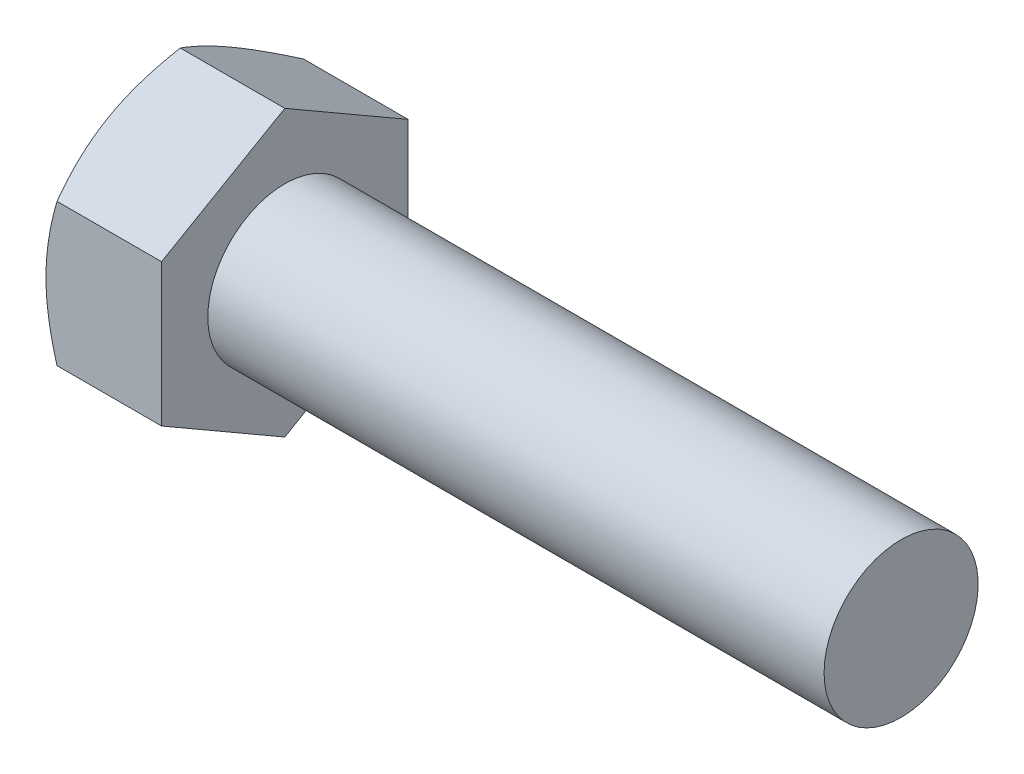
ISO-10303-21;
HEADER;
FILE_DESCRIPTION(('STEP AP214'),'2;1');
FILE_NAME('part.step','',(''),(''),'','','');
FILE_SCHEMA(('AUTOMOTIVE_DESIGN { 1 0 10303 214 1 1 1 1 }'));
ENDSEC;
DATA;
#1=APPLICATION_CONTEXT('core data for automotive mechanical design processes');
#2=APPLICATION_PROTOCOL_DEFINITION('international standard','automotive_design',2000,#1);
#3=PRODUCT_CONTEXT('',#1,'mechanical');
#4=PRODUCT('Part','Part','',(#3));
#5=PRODUCT_RELATED_PRODUCT_CATEGORY('part','',(#4));
#6=PRODUCT_DEFINITION_FORMATION('','',#4);
#7=PRODUCT_DEFINITION_CONTEXT('part definition',#1,'design');
#8=PRODUCT_DEFINITION('design','',#6,#7);
#9=PRODUCT_DEFINITION_SHAPE('','',#8);
#10=(LENGTH_UNIT() NAMED_UNIT(*) SI_UNIT(.MILLI.,.METRE.));
#11=(NAMED_UNIT(*) PLANE_ANGLE_UNIT() SI_UNIT($,.RADIAN.));
#12=(NAMED_UNIT(*) SI_UNIT($,.STERADIAN.) SOLID_ANGLE_UNIT());
#13=UNCERTAINTY_MEASURE_WITH_UNIT(LENGTH_MEASURE(1.E-05),#10,'distance_accuracy_value','');
#14=(GEOMETRIC_REPRESENTATION_CONTEXT(3) GLOBAL_UNCERTAINTY_ASSIGNED_CONTEXT((#13)) GLOBAL_UNIT_ASSIGNED_CONTEXT((#10,
#11,#12)) REPRESENTATION_CONTEXT('',''));
#15=CARTESIAN_POINT('',(0.,0.,0.));
#16=DIRECTION('',(0.,0.,1.));
#17=DIRECTION('',(1.,0.,0.));
#18=AXIS2_PLACEMENT_3D('',#15,#16,#17);
#19=CARTESIAN_POINT('',(7.5,4.99999999999999,0.));
#20=DIRECTION('',(-1.,0.,0.));
#21=DIRECTION('',(0.,0.,1.));
#22=AXIS2_PLACEMENT_3D('',#19,#20,#21);
#23=PLANE('',#22);
#24=CARTESIAN_POINT('',(7.5,0.,0.));
#25=DIRECTION('',(-1.,0.,0.));
#26=DIRECTION('',(0.,0.,1.));
#27=AXIS2_PLACEMENT_3D('',#24,#25,#26);
#28=CIRCLE('',#27,4.99999999999999);
#29=CARTESIAN_POINT('',(7.5,0.,4.99999999999999));
#30=VERTEX_POINT('',#29);
#31=EDGE_CURVE('E195',#30,#30,#28,.T.);
#32=ORIENTED_EDGE('',*,*,#31,.T.);
#33=EDGE_LOOP('',(#32));
#34=FACE_BOUND('',#33,.T.);
#35=DIRECTION('',(0.,1.,0.));
#36=VECTOR('',#35,1.);
#37=CARTESIAN_POINT('',(7.5,-4.61880217370055,8.));
#38=LINE('',#37,#36);
#39=CARTESIAN_POINT('',(7.5,-4.61880217370055,8.));
#40=VERTEX_POINT('',#39);
#41=CARTESIAN_POINT('',(7.5,4.61880217370081,8.));
#42=VERTEX_POINT('',#41);
#43=EDGE_CURVE('E55',#40,#42,#38,.T.);
#44=ORIENTED_EDGE('',*,*,#43,.F.);
#45=DIRECTION('',(0.,0.50000000163871,0.866025402838329));
#46=VECTOR('',#45,1.);
#47=CARTESIAN_POINT('',(7.5,-9.23760434740123,0.));
#48=LINE('',#47,#46);
#49=CARTESIAN_POINT('',(7.5,-9.23760434740123,0.));
#50=VERTEX_POINT('',#49);
#51=EDGE_CURVE('E128',#50,#40,#48,.T.);
#52=ORIENTED_EDGE('',*,*,#51,.F.);
#53=DIRECTION('',(0.,-0.50000000163871,0.866025402838329));
#54=VECTOR('',#53,1.);
#55=CARTESIAN_POINT('',(7.5,-4.61880217370055,-8.));
#56=LINE('',#55,#54);
#57=CARTESIAN_POINT('',(7.5,-4.61880217370055,-8.));
#58=VERTEX_POINT('',#57);
#59=EDGE_CURVE('E126',#58,#50,#56,.T.);
#60=ORIENTED_EDGE('',*,*,#59,.F.);
#61=DIRECTION('',(0.,-1.,0.));
#62=VECTOR('',#61,1.);
#63=CARTESIAN_POINT('',(7.5,4.61880217370081,-8.));
#64=LINE('',#63,#62);
#65=CARTESIAN_POINT('',(7.5,4.61880217370081,-8.));
#66=VERTEX_POINT('',#65);
#67=EDGE_CURVE('E109',#66,#58,#64,.T.);
#68=ORIENTED_EDGE('',*,*,#67,.F.);
#69=DIRECTION('',(0.,-0.50000000163871,-0.866025402838329));
#70=VECTOR('',#69,1.);
#71=CARTESIAN_POINT('',(7.5,9.23760434740149,0.));
#72=LINE('',#71,#70);
#73=CARTESIAN_POINT('',(7.5,9.23760434740148,0.));
#74=VERTEX_POINT('',#73);
#75=EDGE_CURVE('E118',#74,#66,#72,.T.);
#76=ORIENTED_EDGE('',*,*,#75,.F.);
#77=DIRECTION('',(0.,0.50000000163871,-0.866025402838329));
#78=VECTOR('',#77,1.);
#79=CARTESIAN_POINT('',(7.5,4.61880217370081,8.));
#80=LINE('',#79,#78);
#81=EDGE_CURVE('E122',#42,#74,#80,.T.);
#82=ORIENTED_EDGE('',*,*,#81,.F.);
#83=EDGE_LOOP('',(#44,#52,#60,#68,#76,#82));
#84=FACE_BOUND('',#83,.T.);
#85=ADVANCED_FACE('F32',(#34,#84),#23,.F.);
#86=CARTESIAN_POINT('',(-25.4,0.,0.));
#87=DIRECTION('',(-1.,0.,0.));
#88=DIRECTION('',(0.,0.,1.));
#89=AXIS2_PLACEMENT_3D('',#86,#87,#88);
#90=CYLINDRICAL_SURFACE('',#89,4.99999999999999);
#91=CARTESIAN_POINT('',(47.5,0.,0.));
#92=DIRECTION('',(-1.,0.,0.));
#93=DIRECTION('',(0.,0.,1.));
#94=AXIS2_PLACEMENT_3D('',#91,#92,#93);
#95=CIRCLE('',#94,4.99999999999999);
#96=CARTESIAN_POINT('',(47.5,0.,4.99999999999999));
#97=VERTEX_POINT('',#96);
#98=EDGE_CURVE('E11',#97,#97,#95,.T.);
#99=ORIENTED_EDGE('',*,*,#98,.T.);
#100=EDGE_LOOP('',(#99));
#101=FACE_BOUND('',#100,.T.);
#102=ORIENTED_EDGE('',*,*,#31,.F.);
#103=EDGE_LOOP('',(#102));
#104=FACE_BOUND('',#103,.T.);
#105=ADVANCED_FACE('F34',(#101,#104),#90,.T.);
#106=CARTESIAN_POINT('',(47.5,4.99999999999999,0.));
#107=DIRECTION('',(1.,0.,0.));
#108=DIRECTION('',(0.,0.,-1.));
#109=AXIS2_PLACEMENT_3D('',#106,#107,#108);
#110=PLANE('',#109);
#111=ORIENTED_EDGE('',*,*,#98,.F.);
#112=EDGE_LOOP('',(#111));
#113=FACE_BOUND('',#112,.T.);
#114=ADVANCED_FACE('F176',(#113),#110,.T.);
#115=CARTESIAN_POINT('',(7.5,-4.61880217370055,8.));
#116=DIRECTION('',(0.,0.,1.));
#117=DIRECTION('',(1.,0.,0.));
#118=AXIS2_PLACEMENT_3D('',#115,#116,#117);
#119=PLANE('',#118);
#120=DIRECTION('',(-1.,0.,0.));
#121=VECTOR('',#120,1.);
#122=CARTESIAN_POINT('',(7.5,-4.61880217370055,8.));
#123=LINE('',#122,#121);
#124=CARTESIAN_POINT('',(0.714531185642818,-4.61880217370055,8.));
#125=VERTEX_POINT('',#124);
#126=EDGE_CURVE('E135',#40,#125,#123,.T.);
#127=ORIENTED_EDGE('',*,*,#126,.F.);
#128=ORIENTED_EDGE('',*,*,#43,.T.);
#129=DIRECTION('',(-1.,0.,0.));
#130=VECTOR('',#129,1.);
#131=CARTESIAN_POINT('',(7.5,4.61880217370081,8.));
#132=LINE('',#131,#130);
#133=CARTESIAN_POINT('',(0.714531185642892,4.61880217370081,8.));
#134=VERTEX_POINT('',#133);
#135=EDGE_CURVE('E134',#42,#134,#132,.T.);
#136=ORIENTED_EDGE('',*,*,#135,.T.);
#137=CARTESIAN_POINT('',(3.82822414101115,-12.2497656982226,8.));
#138=CARTESIAN_POINT('',(3.65848286879736,-11.8985202843054,8.));
#139=CARTESIAN_POINT('',(3.49042895769105,-11.546444421205,8.));
#140=CARTESIAN_POINT('',(3.15866007606797,-10.8401827517385,8.));
#141=CARTESIAN_POINT('',(2.99494585678538,-10.4859965928938,8.));
#142=CARTESIAN_POINT('',(2.67195812645104,-9.77315201266954,8.));
#143=CARTESIAN_POINT('',(2.51271538890513,-9.41447959727725,8.));
#144=CARTESIAN_POINT('',(2.20106973608564,-8.6941868708221,8.));
#145=CARTESIAN_POINT('',(2.04866646428538,-8.33256671458254,8.));
#146=CARTESIAN_POINT('',(1.75070912610617,-7.60131370455928,8.));
#147=CARTESIAN_POINT('',(1.60526212024156,-7.23163698414151,8.));
#148=CARTESIAN_POINT('',(1.3257593237083,-6.487924160903,8.));
#149=CARTESIAN_POINT('',(1.19170480039106,-6.11388757832081,8.));
#150=CARTESIAN_POINT('',(0.938589488850546,-5.36162356561332,8.));
#151=CARTESIAN_POINT('',(0.819496824182951,-4.98340697934676,8.));
#152=CARTESIAN_POINT('',(0.600170997908567,-4.22161055060635,8.));
#153=CARTESIAN_POINT('',(0.499931872278407,-3.83803244555409,8.));
#154=CARTESIAN_POINT('',(0.323186748232368,-3.06518689861531,8.));
#155=CARTESIAN_POINT('',(0.246687067909604,-2.67591797096946,8.));
#156=CARTESIAN_POINT('',(0.153572527253889,-2.08858914234208,8.));
#157=CARTESIAN_POINT('',(0.126138156302347,-1.89221786409481,8.));
#158=CARTESIAN_POINT('',(0.0790208692877611,-1.49855462524936,8.));
#159=CARTESIAN_POINT('',(0.0593371858268389,-1.30126275775715,8.));
#160=CARTESIAN_POINT('',(0.0282509892994623,-0.907276578206895,8.));
#161=CARTESIAN_POINT('',(0.0167970522476367,-0.710586340026116,8.));
#162=CARTESIAN_POINT('',(0.00223090595897309,-0.316897324952119,8.));
#163=CARTESIAN_POINT('',(-0.000881411608058955,-0.119898552098996,8.));
#164=CARTESIAN_POINT('',(0.00130984053934708,0.273997538414059,8.));
#165=CARTESIAN_POINT('',(0.00661104833169363,0.470894869030628,8.));
#166=CARTESIAN_POINT('',(0.0254975236721262,0.864294473957555,8.));
#167=CARTESIAN_POINT('',(0.0390832049236083,1.0607967280472,8.));
#168=CARTESIAN_POINT('',(0.0817669665798442,1.53705699197599,8.));
#169=CARTESIAN_POINT('',(0.115015825491789,1.81644908989183,8.));
#170=CARTESIAN_POINT('',(0.196415724202102,2.37309234461894,8.));
#171=CARTESIAN_POINT('',(0.244570831513711,2.65034289586915,8.));
#172=CARTESIAN_POINT('',(0.354075319593898,3.20247432368565,8.));
#173=CARTESIAN_POINT('',(0.415437175577189,3.47735270235345,8.));
#174=CARTESIAN_POINT('',(0.549482936842536,4.02428135859503,8.));
#175=CARTESIAN_POINT('',(0.622165775535718,4.29633190001608,8.));
#176=CARTESIAN_POINT('',(0.779014575856637,4.8443054564892,8.));
#177=CARTESIAN_POINT('',(0.863418343438948,5.12015993256326,8.));
#178=CARTESIAN_POINT('',(1.04056550506418,5.66895309638316,8.));
#179=CARTESIAN_POINT('',(1.13330314694986,5.9418936519788,8.));
#180=CARTESIAN_POINT('',(1.32520246628365,6.48376376437685,8.));
#181=CARTESIAN_POINT('',(1.42432504691621,6.75270725047685,8.));
#182=CARTESIAN_POINT('',(1.62838816906517,7.28850759026013,8.));
#183=CARTESIAN_POINT('',(1.73333106198455,7.55536355016898,8.));
#184=CARTESIAN_POINT('',(1.84060835471515,7.82125004980533,8.));
#185=B_SPLINE_CURVE_WITH_KNOTS('',3,(#137,#138,#139,#140,#141,#142,#143,#144,#145,#146,#147,
#148,#149,#150,#151,#152,#153,#154,#155,#156,#157,#158,#159,#160,#161,#162,#163,#164,#165,#166,
#167,#168,#169,#170,#171,#172,#173,#174,#175,#176,#177,#178,#179,#180,#181,#182,#183,#184),
.UNSPECIFIED.,.F.,.F.,(4,2,2,2,2,2,2,2,2,2,2,2,2,2,2,2,2,2,2,2,2,2,2,4),(0.,1.17034426617222,
2.34088982216394,3.51813389970139,4.6953165385788,5.88695165739568,7.0787191660535,
8.26790291341459,9.45670984600031,10.6458329007115,11.2405391306507,11.8351864637341,
12.4260850123376,13.0169758870758,13.6077009108411,14.1984554361754,15.0420758899104,
15.8859267481502,16.7305782416716,17.5751502057393,18.4404245595524,19.3051062097702,
20.1649208601746,21.0250854420212),.UNSPECIFIED.);
#186=CARTESIAN_POINT('',(0.,0.,8.));
#187=VERTEX_POINT('',#186);
#188=EDGE_CURVE('E178',#187,#134,#185,.T.);
#189=ORIENTED_EDGE('',*,*,#188,.F.);
#190=EDGE_CURVE('E186',#125,#187,#185,.T.);
#191=ORIENTED_EDGE('',*,*,#190,.F.);
#192=EDGE_LOOP('',(#127,#128,#136,#189,#191));
#193=FACE_BOUND('',#192,.T.);
#194=ADVANCED_FACE('F172',(#193),#119,.T.);
#195=CARTESIAN_POINT('',(7.5,-9.23760434740123,0.));
#196=DIRECTION('',(0.,-0.866025402838329,0.50000000163871));
#197=DIRECTION('',(0.,-0.50000000163871,-0.866025402838329));
#198=AXIS2_PLACEMENT_3D('',#195,#196,#197);
#199=PLANE('',#198);
#200=DIRECTION('',(-1.,0.,0.));
#201=VECTOR('',#200,1.);
#202=CARTESIAN_POINT('',(7.5,-9.23760434740123,0.));
#203=LINE('',#202,#201);
#204=CARTESIAN_POINT('',(0.714531203122354,-9.23760434740123,0.));
#205=VERTEX_POINT('',#204);
#206=EDGE_CURVE('E139',#50,#205,#203,.T.);
#207=ORIENTED_EDGE('',*,*,#206,.F.);
#208=ORIENTED_EDGE('',*,*,#51,.T.);
#209=ORIENTED_EDGE('',*,*,#126,.T.);
#210=CARTESIAN_POINT('',(0.714597871039296,-9.23771981745557,-0.0002000000000001));
#211=CARTESIAN_POINT('',(0.655990736923309,-9.13619347400029,0.175648784402794));
#212=CARTESIAN_POINT('',(0.600043423495622,-9.03428860437913,0.352153195354024));
#213=CARTESIAN_POINT('',(0.494201026626139,-8.82965126370277,0.706595464982377));
#214=CARTESIAN_POINT('',(0.444308555613364,-8.72691845566661,0.884533907327669));
#215=CARTESIAN_POINT('',(0.304692817146088,-8.41707515629909,1.42119824187181));
#216=CARTESIAN_POINT('',(0.225281190112565,-8.20874157525887,1.78204258757938));
#217=CARTESIAN_POINT('',(0.13216166430539,-7.89697439751329,2.32203917720736));
#218=CARTESIAN_POINT('',(0.105634598683684,-7.79447219608365,2.49957819719533));
#219=CARTESIAN_POINT('',(0.0611531918321849,-7.58900424766936,2.85545912162067));
#220=CARTESIAN_POINT('',(0.0431980931629744,-7.4860385424529,3.03380095371339));
#221=CARTESIAN_POINT('',(0.0163156645301174,-7.27992984087247,3.39079169517274));
#222=CARTESIAN_POINT('',(0.00737808929917002,-7.17678717937825,3.56944002452793));
#223=CARTESIAN_POINT('',(-0.00127768080582724,-6.97040657400776,3.92690171716438));
#224=CARTESIAN_POINT('',(-0.000996160506699113,-6.86716863317371,4.10571507517634));
#225=CARTESIAN_POINT('',(0.00814503983248963,-6.67416141624368,4.44001337966577));
#226=CARTESIAN_POINT('',(0.0158896186877223,-6.58437852030024,4.59552191641092));
#227=CARTESIAN_POINT('',(0.038201148635654,-6.40502300933048,4.90617477267052));
#228=CARTESIAN_POINT('',(0.0527685596255939,-6.31545040888835,5.06131906692438));
#229=CARTESIAN_POINT('',(0.106360703064383,-6.04707937863194,5.52615132457682));
#230=CARTESIAN_POINT('',(0.155268653484361,-5.86875598870038,5.83501649476649));
#231=CARTESIAN_POINT('',(0.277539413477514,-5.51021757899271,6.45602323413139));
#232=CARTESIAN_POINT('',(0.351420529762541,-5.33004831822991,6.768085546371));
#233=CARTESIAN_POINT('',(0.519100148881203,-4.97239660419655,7.38755648378386));
#234=CARTESIAN_POINT('',(0.612859267577921,-4.79490957082323,7.69497304192775));
#235=CARTESIAN_POINT('',(0.714597853559104,-4.61868670364621,8.0002));
#236=B_SPLINE_CURVE_WITH_KNOTS('',3,(#210,#211,#212,#213,#214,#215,#216,#217,#218,#219,#220,
#221,#222,#223,#224,#225,#226,#227,#228,#229,#230,#231,#232,#233,#234,#235),.UNSPECIFIED.,.F.,
.F.,(4,2,2,2,2,2,2,2,2,2,2,2,4),(0.,0.633973546459013,1.26821966262013,2.53934713534089,
3.15934345345195,3.77928497706708,4.39852135771862,5.01773860688775,5.55680241439714,
6.09590256306805,7.17487079008232,8.27776851436756,9.37850116222514),.UNSPECIFIED.);
#237=CARTESIAN_POINT('',(0.,-6.92820324541317,4.0000000262193));
#238=VERTEX_POINT('',#237);
#239=EDGE_CURVE('E188',#238,#125,#236,.T.);
#240=ORIENTED_EDGE('',*,*,#239,.F.);
#241=EDGE_CURVE('E187',#205,#238,#236,.T.);
#242=ORIENTED_EDGE('',*,*,#241,.F.);
#243=EDGE_LOOP('',(#207,#208,#209,#240,#242));
#244=FACE_BOUND('',#243,.T.);
#245=ADVANCED_FACE('F175',(#244),#199,.T.);
#246=CARTESIAN_POINT('',(7.5,-4.61880217370055,-8.));
#247=DIRECTION('',(0.,-0.866025402838329,-0.50000000163871));
#248=DIRECTION('',(0.,0.50000000163871,-0.866025402838329));
#249=AXIS2_PLACEMENT_3D('',#246,#247,#248);
#250=PLANE('',#249);
#251=DIRECTION('',(-1.,0.,0.));
#252=VECTOR('',#251,1.);
#253=CARTESIAN_POINT('',(7.5,-4.61880217370055,-8.));
#254=LINE('',#253,#252);
#255=CARTESIAN_POINT('',(0.714531185642818,-4.61880217370055,-8.));
#256=VERTEX_POINT('',#255);
#257=EDGE_CURVE('E115',#58,#256,#254,.T.);
#258=ORIENTED_EDGE('',*,*,#257,.F.);
#259=ORIENTED_EDGE('',*,*,#59,.T.);
#260=ORIENTED_EDGE('',*,*,#206,.T.);
#261=CARTESIAN_POINT('',(0.714597853559106,-4.61868670364621,-8.0002));
#262=CARTESIAN_POINT('',(0.65599072016066,-4.72021304685638,-7.82435121602175));
#263=CARTESIAN_POINT('',(0.600043407468515,-4.82211791623125,-7.64784680549711));
#264=CARTESIAN_POINT('',(0.494201012103506,-5.02675525640989,-7.29340453673082));
#265=CARTESIAN_POINT('',(0.444308541859676,-5.12948806419463,-7.11546609482101));
#266=CARTESIAN_POINT('',(0.304692805754272,-5.43933136278073,-6.57880176163032));
#267=CARTESIAN_POINT('',(0.22528118035716,-5.64766494327923,-6.21795741686103));
#268=CARTESIAN_POINT('',(0.132161657001103,-5.95943212018714,-5.67796082868395));
#269=CARTESIAN_POINT('',(0.105634592184737,-6.06193432134328,-5.5004218091697));
#270=CARTESIAN_POINT('',(0.0611531869346983,-6.2674022691947,-5.14454088571928));
#271=CARTESIAN_POINT('',(0.0431980890616169,-6.37036797412179,-4.96619905412775));
#272=CARTESIAN_POINT('',(0.016315661991493,-6.57647667510862,-4.60920831369654));
#273=CARTESIAN_POINT('',(0.00737808752736497,-6.67961933629864,-4.43055998486825));
#274=CARTESIAN_POINT('',(-0.00127768109245089,-6.88599994104392,-4.07309829331471));
#275=CARTESIAN_POINT('',(-0.000996160074943611,-6.98923788155696,-3.89428493585874));
#276=CARTESIAN_POINT('',(0.00814504157394332,-7.18224509847458,-3.5599866313908));
#277=CARTESIAN_POINT('',(0.0158896210753668,-7.27202799472784,-3.40447809410903));
#278=CARTESIAN_POINT('',(0.0382011523455345,-7.45138350630451,-3.09382523679824));
#279=CARTESIAN_POINT('',(0.0527685640115304,-7.54095610704372,-2.93868094202981));
#280=CARTESIAN_POINT('',(0.106360709504685,-7.80932713817435,-2.47384868286318));
#281=CARTESIAN_POINT('',(0.155268661328175,-7.98765052866424,-2.16498351170646));
#282=CARTESIAN_POINT('',(0.277539424141205,-8.34618893947705,-1.54397677042741));
#283=CARTESIAN_POINT('',(0.351420541844043,-8.52635820078562,-1.23191445724248));
#284=CARTESIAN_POINT('',(0.519100163726603,-8.88400991587941,-0.612443517992906));
#285=CARTESIAN_POINT('',(0.612859283768849,-9.06149694976751,-0.305026958957409));
#286=CARTESIAN_POINT('',(0.714597871039296,-9.23771981745557,0.000199999999999587));
#287=B_SPLINE_CURVE_WITH_KNOTS('',3,(#261,#262,#263,#264,#265,#266,#267,#268,#269,#270,#271,
#272,#273,#274,#275,#276,#277,#278,#279,#280,#281,#282,#283,#284,#285,#286),.UNSPECIFIED.,.F.,
.F.,(4,2,2,2,2,2,2,2,2,2,2,2,4),(0.,0.633973544448733,1.26821965859846,2.539347127198,
3.1593434433715,3.77928496504979,4.39852134377931,5.01773859102754,5.55680240047657,
6.09590255108796,7.17487078199376,8.27776851034647,9.37850116222567),.UNSPECIFIED.);
#288=CARTESIAN_POINT('',(0.,-6.92820324541317,-4.0000000262193));
#289=VERTEX_POINT('',#288);
#290=EDGE_CURVE('E218',#289,#205,#287,.T.);
#291=ORIENTED_EDGE('',*,*,#290,.F.);
#292=EDGE_CURVE('E223',#256,#289,#287,.T.);
#293=ORIENTED_EDGE('',*,*,#292,.F.);
#294=EDGE_LOOP('',(#258,#259,#260,#291,#293));
#295=FACE_BOUND('',#294,.T.);
#296=ADVANCED_FACE('F294',(#295),#250,.T.);
#297=CARTESIAN_POINT('',(7.5,4.61880217370081,-8.));
#298=DIRECTION('',(0.,0.,-1.));
#299=DIRECTION('',(-1.,0.,0.));
#300=AXIS2_PLACEMENT_3D('',#297,#298,#299);
#301=PLANE('',#300);
#302=DIRECTION('',(-1.,0.,0.));
#303=VECTOR('',#302,1.);
#304=CARTESIAN_POINT('',(7.5,4.61880217370081,-8.));
#305=LINE('',#304,#303);
#306=CARTESIAN_POINT('',(0.714531185642892,4.61880217370081,-8.));
#307=VERTEX_POINT('',#306);
#308=EDGE_CURVE('E104',#66,#307,#305,.T.);
#309=ORIENTED_EDGE('',*,*,#308,.F.);
#310=ORIENTED_EDGE('',*,*,#67,.T.);
#311=ORIENTED_EDGE('',*,*,#257,.T.);
#312=CARTESIAN_POINT('',(3.82822414101115,-12.2497656982226,-8.));
#313=CARTESIAN_POINT('',(3.65848286879736,-11.8985202843054,-8.));
#314=CARTESIAN_POINT('',(3.49042895769105,-11.546444421205,-8.));
#315=CARTESIAN_POINT('',(3.15866007606797,-10.8401827517385,-8.));
#316=CARTESIAN_POINT('',(2.99494585678538,-10.4859965928938,-8.));
#317=CARTESIAN_POINT('',(2.67195812645104,-9.77315201266954,-8.));
#318=CARTESIAN_POINT('',(2.51271538890513,-9.41447959727725,-8.));
#319=CARTESIAN_POINT('',(2.20106973608564,-8.6941868708221,-8.));
#320=CARTESIAN_POINT('',(2.04866646428538,-8.33256671458254,-8.));
#321=CARTESIAN_POINT('',(1.75070912610617,-7.60131370455928,-8.));
#322=CARTESIAN_POINT('',(1.60526212024156,-7.23163698414151,-8.));
#323=CARTESIAN_POINT('',(1.3257593237083,-6.487924160903,-8.));
#324=CARTESIAN_POINT('',(1.19170480039106,-6.11388757832081,-8.));
#325=CARTESIAN_POINT('',(0.938589488850546,-5.36162356561332,-8.));
#326=CARTESIAN_POINT('',(0.819496824182951,-4.98340697934676,-8.));
#327=CARTESIAN_POINT('',(0.600170997908567,-4.22161055060635,-8.));
#328=CARTESIAN_POINT('',(0.499931872278407,-3.83803244555409,-8.));
#329=CARTESIAN_POINT('',(0.323186748232368,-3.06518689861531,-8.));
#330=CARTESIAN_POINT('',(0.246687067909604,-2.67591797096946,-8.));
#331=CARTESIAN_POINT('',(0.153572527253889,-2.08858914234208,-8.));
#332=CARTESIAN_POINT('',(0.126138156302347,-1.89221786409481,-8.));
#333=CARTESIAN_POINT('',(0.0790208692877611,-1.49855462524936,-8.));
#334=CARTESIAN_POINT('',(0.0593371858268389,-1.30126275775715,-8.));
#335=CARTESIAN_POINT('',(0.0282509892994623,-0.907276578206895,-8.));
#336=CARTESIAN_POINT('',(0.0167970522476367,-0.710586340026116,-8.));
#337=CARTESIAN_POINT('',(0.00223090595897309,-0.316897324952119,-8.));
#338=CARTESIAN_POINT('',(-0.000881411608058955,-0.119898552098996,-8.));
#339=CARTESIAN_POINT('',(0.00130984053934708,0.273997538414059,-8.));
#340=CARTESIAN_POINT('',(0.00661104833169363,0.470894869030628,-8.));
#341=CARTESIAN_POINT('',(0.0254975236721262,0.864294473957555,-8.));
#342=CARTESIAN_POINT('',(0.0390832049236083,1.0607967280472,-8.));
#343=CARTESIAN_POINT('',(0.0817669665798442,1.53705699197599,-8.));
#344=CARTESIAN_POINT('',(0.115015825491789,1.81644908989183,-8.));
#345=CARTESIAN_POINT('',(0.196415724202102,2.37309234461894,-8.));
#346=CARTESIAN_POINT('',(0.244570831513711,2.65034289586915,-8.));
#347=CARTESIAN_POINT('',(0.354075319593898,3.20247432368565,-8.));
#348=CARTESIAN_POINT('',(0.415437175577189,3.47735270235345,-8.));
#349=CARTESIAN_POINT('',(0.549482936842536,4.02428135859503,-8.));
#350=CARTESIAN_POINT('',(0.622165775535718,4.29633190001608,-8.));
#351=CARTESIAN_POINT('',(0.779014575856637,4.8443054564892,-8.));
#352=CARTESIAN_POINT('',(0.863418343438948,5.12015993256326,-8.));
#353=CARTESIAN_POINT('',(1.04056550506418,5.66895309638316,-8.));
#354=CARTESIAN_POINT('',(1.13330314694986,5.9418936519788,-8.));
#355=CARTESIAN_POINT('',(1.32520246628365,6.48376376437685,-8.));
#356=CARTESIAN_POINT('',(1.42432504691621,6.75270725047685,-8.));
#357=CARTESIAN_POINT('',(1.62838816906517,7.28850759026013,-8.));
#358=CARTESIAN_POINT('',(1.73333106198455,7.55536355016898,-8.));
#359=CARTESIAN_POINT('',(1.84060835471515,7.82125004980533,-8.));
#360=B_SPLINE_CURVE_WITH_KNOTS('',3,(#312,#313,#314,#315,#316,#317,#318,#319,#320,#321,#322,
#323,#324,#325,#326,#327,#328,#329,#330,#331,#332,#333,#334,#335,#336,#337,#338,#339,#340,#341,
#342,#343,#344,#345,#346,#347,#348,#349,#350,#351,#352,#353,#354,#355,#356,#357,#358,#359),
.UNSPECIFIED.,.F.,.F.,(4,2,2,2,2,2,2,2,2,2,2,2,2,2,2,2,2,2,2,2,2,2,2,4),(0.,1.17034426617222,
2.34088982216394,3.51813389970139,4.6953165385788,5.88695165739568,7.0787191660535,
8.26790291341459,9.45670984600031,10.6458329007115,11.2405391306507,11.8351864637341,
12.4260850123376,13.0169758870758,13.6077009108411,14.1984554361754,15.0420758899104,
15.8859267481502,16.7305782416716,17.5751502057393,18.4404245595524,19.3051062097702,
20.1649208601746,21.0250854420212),.UNSPECIFIED.);
#361=CARTESIAN_POINT('',(0.,0.,-8.));
#362=VERTEX_POINT('',#361);
#363=EDGE_CURVE('E219',#362,#256,#360,.F.);
#364=ORIENTED_EDGE('',*,*,#363,.F.);
#365=EDGE_CURVE('E112',#307,#362,#360,.F.);
#366=ORIENTED_EDGE('',*,*,#365,.F.);
#367=EDGE_LOOP('',(#309,#310,#311,#364,#366));
#368=FACE_BOUND('',#367,.T.);
#369=ADVANCED_FACE('F106',(#368),#301,.T.);
#370=CARTESIAN_POINT('',(7.5,9.23760434740149,0.));
#371=DIRECTION('',(0.,0.866025402838329,-0.50000000163871));
#372=DIRECTION('',(0.,0.50000000163871,0.866025402838329));
#373=AXIS2_PLACEMENT_3D('',#370,#371,#372);
#374=PLANE('',#373);
#375=DIRECTION('',(-1.,0.,0.));
#376=VECTOR('',#375,1.);
#377=CARTESIAN_POINT('',(7.5,9.23760434740149,0.));
#378=LINE('',#377,#376);
#379=CARTESIAN_POINT('',(0.714531203122502,9.23760434740149,0.));
#380=VERTEX_POINT('',#379);
#381=EDGE_CURVE('E47',#74,#380,#378,.T.);
#382=ORIENTED_EDGE('',*,*,#381,.F.);
#383=ORIENTED_EDGE('',*,*,#75,.T.);
#384=ORIENTED_EDGE('',*,*,#308,.T.);
#385=CARTESIAN_POINT('',(0.714597871039444,9.23771981745583,0.000200000000000146));
#386=CARTESIAN_POINT('',(0.655990736923456,9.13619347400054,-0.175648784402799));
#387=CARTESIAN_POINT('',(0.600043423495768,9.03428860437938,-0.352153195354034));
#388=CARTESIAN_POINT('',(0.494201026626282,8.82965126370302,-0.706595464982396));
#389=CARTESIAN_POINT('',(0.444308555613505,8.72691845566685,-0.884533907327693));
#390=CARTESIAN_POINT('',(0.304692817146224,8.41707515629933,-1.42119824187185));
#391=CARTESIAN_POINT('',(0.2252811901127,8.2087415752591,-1.78204258757943));
#392=CARTESIAN_POINT('',(0.132161664305522,7.89697439751352,-2.32203917720742));
#393=CARTESIAN_POINT('',(0.105634598683815,7.79447219608387,-2.4995781971954));
#394=CARTESIAN_POINT('',(0.0611531918323152,7.58900424766957,-2.85545912162075));
#395=CARTESIAN_POINT('',(0.0431980931631046,7.48603854245311,-3.03380095371348));
#396=CARTESIAN_POINT('',(0.0163156645302469,7.27992984087268,-3.39079169517283));
#397=CARTESIAN_POINT('',(0.00737808929929885,7.17678717937845,-3.56944002452803));
#398=CARTESIAN_POINT('',(-0.00127768080569918,6.97040657400795,-3.92690171716449));
#399=CARTESIAN_POINT('',(-0.000996160506571202,6.8671686331739,-4.10571507517646));
#400=CARTESIAN_POINT('',(0.00814503983261781,6.67416141624387,-4.44001337966589));
#401=CARTESIAN_POINT('',(0.0158896186878504,6.58437852030044,-4.59552191641103));
#402=CARTESIAN_POINT('',(0.0382011486357808,6.40502300933068,-4.90617477267062));
#403=CARTESIAN_POINT('',(0.0527685596257195,6.31545040888856,-5.06131906692447));
#404=CARTESIAN_POINT('',(0.106360703064504,6.04707937863215,-5.5261513245769));
#405=CARTESIAN_POINT('',(0.155268653484479,5.8687559887006,-5.83501649476656));
#406=CARTESIAN_POINT('',(0.277539413477622,5.51021757899294,-6.45602323413144));
#407=CARTESIAN_POINT('',(0.351420529762643,5.33004831823015,-6.76808554637104));
#408=CARTESIAN_POINT('',(0.519100148881291,4.97239660419679,-7.38755648378388));
#409=CARTESIAN_POINT('',(0.612859267578002,4.79490957082348,-7.69497304192776));
#410=CARTESIAN_POINT('',(0.714597853559178,4.61868670364646,-8.0002));
#411=B_SPLINE_CURVE_WITH_KNOTS('',3,(#385,#386,#387,#388,#389,#390,#391,#392,#393,#394,#395,
#396,#397,#398,#399,#400,#401,#402,#403,#404,#405,#406,#407,#408,#409,#410),.UNSPECIFIED.,.F.,
.F.,(4,2,2,2,2,2,2,2,2,2,2,2,4),(0.,0.63397354645903,1.26821966262016,2.53934713534096,
3.15934345345203,3.77928497706718,4.39852135771874,5.01773860688789,5.55680241439726,
6.09590256306816,7.17487079008239,8.27776851436759,9.37850116222513),.UNSPECIFIED.);
#412=CARTESIAN_POINT('',(0.,6.92820324541336,-4.00000002621942));
#413=VERTEX_POINT('',#412);
#414=EDGE_CURVE('E154',#413,#307,#411,.T.);
#415=ORIENTED_EDGE('',*,*,#414,.F.);
#416=EDGE_CURVE('E282',#380,#413,#411,.T.);
#417=ORIENTED_EDGE('',*,*,#416,.F.);
#418=EDGE_LOOP('',(#382,#383,#384,#415,#417));
#419=FACE_BOUND('',#418,.T.);
#420=ADVANCED_FACE('F119',(#419),#374,.T.);
#421=CARTESIAN_POINT('',(7.5,4.61880217370081,8.));
#422=DIRECTION('',(0.,0.866025402838329,0.50000000163871));
#423=DIRECTION('',(0.,-0.50000000163871,0.866025402838329));
#424=AXIS2_PLACEMENT_3D('',#421,#422,#423);
#425=PLANE('',#424);
#426=ORIENTED_EDGE('',*,*,#135,.F.);
#427=ORIENTED_EDGE('',*,*,#81,.T.);
#428=ORIENTED_EDGE('',*,*,#381,.T.);
#429=CARTESIAN_POINT('',(0.714597853559179,4.61868670364646,8.0002));
#430=CARTESIAN_POINT('',(0.655990720160735,4.72021304685664,7.82435121602175));
#431=CARTESIAN_POINT('',(0.600043407468591,4.82211791623151,7.6478468054971));
#432=CARTESIAN_POINT('',(0.494201012103586,5.02675525641015,7.29340453673081));
#433=CARTESIAN_POINT('',(0.444308541859758,5.1294880641949,7.11546609482099));
#434=CARTESIAN_POINT('',(0.30469280575436,5.439331362781,6.57880176163029));
#435=CARTESIAN_POINT('',(0.225281180357251,5.6476649432795,6.217957416861));
#436=CARTESIAN_POINT('',(0.132161657001203,5.95943212018742,5.67796082868391));
#437=CARTESIAN_POINT('',(0.105634592184841,6.06193432134356,5.50042180916966));
#438=CARTESIAN_POINT('',(0.0611531869348079,6.26740226919499,5.14454088571923));
#439=CARTESIAN_POINT('',(0.0431980890617282,6.37036797412208,4.9661990541277));
#440=CARTESIAN_POINT('',(0.0163156619916095,6.57647667510891,4.60920831369649));
#441=CARTESIAN_POINT('',(0.00737808752748518,6.67961933629893,4.43055998486819));
#442=CARTESIAN_POINT('',(-0.00127768109232372,6.88599994104421,4.07309829331464));
#443=CARTESIAN_POINT('',(-0.000996160074813141,6.98923788155725,3.89428493585868));
#444=CARTESIAN_POINT('',(0.00814504157407925,7.18224509847487,3.55998663139074));
#445=CARTESIAN_POINT('',(0.0158896210755048,7.27202799472813,3.40447809410897));
#446=CARTESIAN_POINT('',(0.0382011523456765,7.4513835063048,3.09382523679819));
#447=CARTESIAN_POINT('',(0.0527685640116745,7.54095610704401,2.93868094202976));
#448=CARTESIAN_POINT('',(0.106360709504834,7.80932713817463,2.47384868286313));
#449=CARTESIAN_POINT('',(0.155268661328325,7.98765052866452,2.16498351170642));
#450=CARTESIAN_POINT('',(0.277539424141357,8.34618893947732,1.54397677042737));
#451=CARTESIAN_POINT('',(0.351420541844195,8.5263582007859,1.23191445724245));
#452=CARTESIAN_POINT('',(0.519100163726754,8.88400991587968,0.612443517992892));
#453=CARTESIAN_POINT('',(0.612859283769,9.06149694976777,0.305026958957401));
#454=CARTESIAN_POINT('',(0.714597871039444,9.23771981745583,-0.000200000000001654));
#455=B_SPLINE_CURVE_WITH_KNOTS('',3,(#429,#430,#431,#432,#433,#434,#435,#436,#437,#438,#439,
#440,#441,#442,#443,#444,#445,#446,#447,#448,#449,#450,#451,#452,#453,#454),.UNSPECIFIED.,.F.,
.F.,(4,2,2,2,2,2,2,2,2,2,2,2,4),(0.,0.633973544448742,1.26821965859848,2.53934712719804,
3.15934344337154,3.77928496504984,4.39852134377938,5.01773859102761,5.55680240047663,
6.09590255108801,7.1748707819938,8.27776851034648,9.37850116222566),.UNSPECIFIED.);
#456=CARTESIAN_POINT('',(0.,6.92820324541336,4.00000002621942));
#457=VERTEX_POINT('',#456);
#458=EDGE_CURVE('E138',#457,#380,#455,.T.);
#459=ORIENTED_EDGE('',*,*,#458,.F.);
#460=EDGE_CURVE('E153',#134,#457,#455,.T.);
#461=ORIENTED_EDGE('',*,*,#460,.F.);
#462=EDGE_LOOP('',(#426,#427,#428,#459,#461));
#463=FACE_BOUND('',#462,.T.);
#464=ADVANCED_FACE('F165',(#463),#425,.T.);
#465=CARTESIAN_POINT('',(0.,0.,0.));
#466=DIRECTION('',(1.,0.,0.));
#467=DIRECTION('',(0.,0.,-1.));
#468=AXIS2_PLACEMENT_3D('',#465,#466,#467);
#469=CONICAL_SURFACE('',#468,7.99999999999999,1.0471975511966);
#470=CARTESIAN_POINT('',(0.,0.,0.));
#471=DIRECTION('',(-1.,0.,0.));
#472=DIRECTION('',(0.,0.,1.));
#473=AXIS2_PLACEMENT_3D('',#470,#471,#472);
#474=CIRCLE('',#473,7.99999999999999);
#475=EDGE_CURVE('E197',#238,#187,#474,.T.);
#476=ORIENTED_EDGE('',*,*,#475,.F.);
#477=ORIENTED_EDGE('',*,*,#239,.T.);
#478=ORIENTED_EDGE('',*,*,#190,.T.);
#479=EDGE_LOOP('',(#476,#477,#478));
#480=FACE_BOUND('',#479,.T.);
#481=ADVANCED_FACE('F169',(#480),#469,.T.);
#482=EDGE_CURVE('E205',#289,#238,#474,.T.);
#483=ORIENTED_EDGE('',*,*,#482,.F.);
#484=ORIENTED_EDGE('',*,*,#290,.T.);
#485=ORIENTED_EDGE('',*,*,#241,.T.);
#486=EDGE_LOOP('',(#483,#484,#485));
#487=FACE_BOUND('',#486,.T.);
#488=ADVANCED_FACE('F228',(#487),#469,.T.);
#489=ORIENTED_EDGE('',*,*,#363,.T.);
#490=ORIENTED_EDGE('',*,*,#292,.T.);
#491=EDGE_CURVE('E208',#362,#289,#474,.T.);
#492=ORIENTED_EDGE('',*,*,#491,.F.);
#493=EDGE_LOOP('',(#489,#490,#492));
#494=FACE_BOUND('',#493,.T.);
#495=ADVANCED_FACE('F161',(#494),#469,.T.);
#496=ORIENTED_EDGE('',*,*,#414,.T.);
#497=ORIENTED_EDGE('',*,*,#365,.T.);
#498=EDGE_CURVE('E204',#413,#362,#474,.T.);
#499=ORIENTED_EDGE('',*,*,#498,.F.);
#500=EDGE_LOOP('',(#496,#497,#499));
#501=FACE_BOUND('',#500,.T.);
#502=ADVANCED_FACE('F217',(#501),#469,.T.);
#503=EDGE_CURVE('E40',#187,#457,#474,.T.);
#504=ORIENTED_EDGE('',*,*,#503,.F.);
#505=ORIENTED_EDGE('',*,*,#188,.T.);
#506=ORIENTED_EDGE('',*,*,#460,.T.);
#507=EDGE_LOOP('',(#504,#505,#506));
#508=FACE_BOUND('',#507,.T.);
#509=ADVANCED_FACE('F256',(#508),#469,.T.);
#510=CARTESIAN_POINT('',(0.,0.,0.));
#511=DIRECTION('',(-1.,0.,0.));
#512=DIRECTION('',(0.,0.,1.));
#513=AXIS2_PLACEMENT_3D('',#510,#511,#512);
#514=PLANE('',#513);
#515=CARTESIAN_POINT('',(0.,0.,0.));
#516=DIRECTION('',(1.,0.,0.));
#517=DIRECTION('',(0.,0.,-1.));
#518=AXIS2_PLACEMENT_3D('',#515,#516,#517);
#519=CIRCLE('',#518,7.);
#520=CARTESIAN_POINT('',(0.,0.,-7.));
#521=VERTEX_POINT('',#520);
#522=EDGE_CURVE('E236',#521,#521,#519,.T.);
#523=ORIENTED_EDGE('',*,*,#522,.T.);
#524=EDGE_LOOP('',(#523));
#525=FACE_BOUND('',#524,.T.);
#526=ORIENTED_EDGE('',*,*,#503,.T.);
#527=EDGE_CURVE('E199',#457,#413,#474,.T.);
#528=ORIENTED_EDGE('',*,*,#527,.T.);
#529=ORIENTED_EDGE('',*,*,#498,.T.);
#530=ORIENTED_EDGE('',*,*,#491,.T.);
#531=ORIENTED_EDGE('',*,*,#482,.T.);
#532=ORIENTED_EDGE('',*,*,#475,.T.);
#533=EDGE_LOOP('',(#526,#528,#529,#530,#531,#532));
#534=FACE_BOUND('',#533,.T.);
#535=ADVANCED_FACE('F214',(#525,#534),#514,.T.);
#536=ORIENTED_EDGE('',*,*,#458,.T.);
#537=ORIENTED_EDGE('',*,*,#416,.T.);
#538=ORIENTED_EDGE('',*,*,#527,.F.);
#539=EDGE_LOOP('',(#536,#537,#538));
#540=FACE_BOUND('',#539,.T.);
#541=ADVANCED_FACE('F246',(#540),#469,.T.);
#542=CARTESIAN_POINT('',(0.9375,0.,0.));
#543=DIRECTION('',(-1.,0.,0.));
#544=DIRECTION('',(0.,0.,1.));
#545=AXIS2_PLACEMENT_3D('',#542,#543,#544);
#546=CYLINDRICAL_SURFACE('',#545,7.);
#547=CARTESIAN_POINT('',(0.9375,0.,0.));
#548=DIRECTION('',(1.,0.,0.));
#549=DIRECTION('',(0.,0.,-1.));
#550=AXIS2_PLACEMENT_3D('',#547,#548,#549);
#551=CIRCLE('',#550,7.);
#552=CARTESIAN_POINT('',(0.9375,0.,-7.));
#553=VERTEX_POINT('',#552);
#554=EDGE_CURVE('E233',#553,#553,#551,.T.);
#555=ORIENTED_EDGE('',*,*,#554,.T.);
#556=EDGE_LOOP('',(#555));
#557=FACE_BOUND('',#556,.T.);
#558=ORIENTED_EDGE('',*,*,#522,.F.);
#559=EDGE_LOOP('',(#558));
#560=FACE_BOUND('',#559,.T.);
#561=ADVANCED_FACE('F243',(#557,#560),#546,.F.);
#562=CARTESIAN_POINT('',(0.9375,0.,0.));
#563=DIRECTION('',(1.,0.,0.));
#564=DIRECTION('',(0.,0.,-1.));
#565=AXIS2_PLACEMENT_3D('',#562,#563,#564);
#566=PLANE('',#565);
#567=ORIENTED_EDGE('',*,*,#554,.F.);
#568=EDGE_LOOP('',(#567));
#569=FACE_BOUND('',#568,.T.);
#570=ADVANCED_FACE('F245',(#569),#566,.F.);
#571=CLOSED_SHELL('',(#85,#105,#114,#194,#245,#296,#369,#420,#464,#481,#488,#495,#502,#509,#535,
#541,#561,#570));
#572=MANIFOLD_SOLID_BREP('B2',#571);
#573=ADVANCED_BREP_SHAPE_REPRESENTATION('',(#18,#572),#14);
#574=SHAPE_DEFINITION_REPRESENTATION(#9,#573);
ENDSEC;
END-ISO-10303-21;
